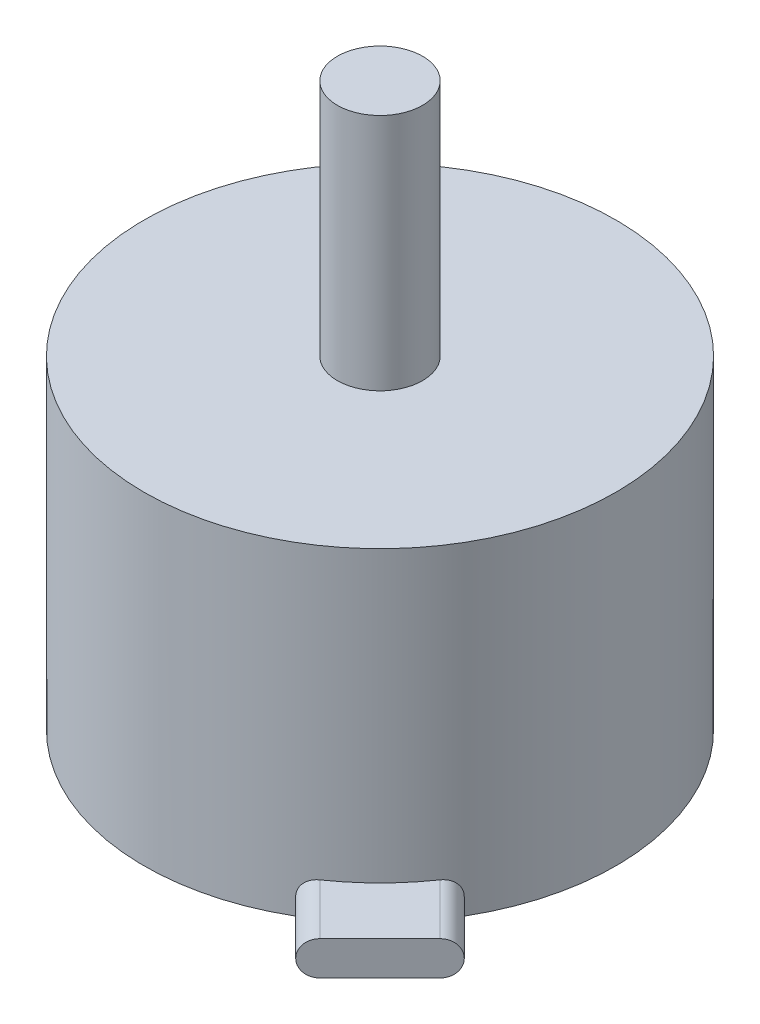
ISO-10303-21;
HEADER;
FILE_DESCRIPTION(('STEP AP214'),'2;1');
FILE_NAME('part.step','',(''),(''),'','','');
FILE_SCHEMA(('AUTOMOTIVE_DESIGN { 1 0 10303 214 1 1 1 1 }'));
ENDSEC;
DATA;
#1=APPLICATION_CONTEXT('core data for automotive mechanical design processes');
#2=APPLICATION_PROTOCOL_DEFINITION('international standard','automotive_design',2000,#1);
#3=PRODUCT_CONTEXT('',#1,'mechanical');
#4=PRODUCT('Part','Part','',(#3));
#5=PRODUCT_RELATED_PRODUCT_CATEGORY('part','',(#4));
#6=PRODUCT_DEFINITION_FORMATION('','',#4);
#7=PRODUCT_DEFINITION_CONTEXT('part definition',#1,'design');
#8=PRODUCT_DEFINITION('design','',#6,#7);
#9=PRODUCT_DEFINITION_SHAPE('','',#8);
#10=(LENGTH_UNIT() NAMED_UNIT(*) SI_UNIT(.MILLI.,.METRE.));
#11=(NAMED_UNIT(*) PLANE_ANGLE_UNIT() SI_UNIT($,.RADIAN.));
#12=(NAMED_UNIT(*) SI_UNIT($,.STERADIAN.) SOLID_ANGLE_UNIT());
#13=UNCERTAINTY_MEASURE_WITH_UNIT(LENGTH_MEASURE(1.E-05),#10,'distance_accuracy_value','');
#14=(GEOMETRIC_REPRESENTATION_CONTEXT(3) GLOBAL_UNCERTAINTY_ASSIGNED_CONTEXT((#13)) GLOBAL_UNIT_ASSIGNED_CONTEXT((#10,
#11,#12)) REPRESENTATION_CONTEXT('',''));
#15=CARTESIAN_POINT('',(0.,0.,0.));
#16=DIRECTION('',(0.,0.,1.));
#17=DIRECTION('',(1.,0.,0.));
#18=AXIS2_PLACEMENT_3D('',#15,#16,#17);
#19=CARTESIAN_POINT('',(0.,19.,0.));
#20=DIRECTION('',(0.,-1.,0.));
#21=DIRECTION('',(0.,0.,-1.));
#22=AXIS2_PLACEMENT_3D('',#19,#20,#21);
#23=CYLINDRICAL_SURFACE('',#22,13.85);
#24=CARTESIAN_POINT('',(0.,19.,0.));
#25=DIRECTION('',(0.,1.,0.));
#26=DIRECTION('',(0.,0.,1.));
#27=AXIS2_PLACEMENT_3D('',#24,#25,#26);
#28=CIRCLE('',#27,13.85);
#29=CARTESIAN_POINT('',(0.,19.,13.85));
#30=VERTEX_POINT('',#29);
#31=EDGE_CURVE('E13',#30,#30,#28,.T.);
#32=ORIENTED_EDGE('',*,*,#31,.F.);
#33=EDGE_LOOP('',(#32));
#34=FACE_BOUND('',#33,.T.);
#35=CARTESIAN_POINT('',(7.86479501158792,2.,11.4003289174349));
#36=CARTESIAN_POINT('',(7.81679979371891,2.00004181126576,11.4334566742897));
#37=CARTESIAN_POINT('',(7.76859718776109,1.99506724076578,11.4662463298621));
#38=CARTESIAN_POINT('',(7.67318775726975,1.975470471216,11.5303029294921));
#39=CARTESIAN_POINT('',(7.62598038634632,1.96085371605953,11.5615707220901));
#40=CARTESIAN_POINT('',(7.53390071781477,1.92235104763441,11.6217854828838));
#41=CARTESIAN_POINT('',(7.48902913454642,1.89846231744292,11.6507317425456));
#42=CARTESIAN_POINT('',(7.40299944011378,1.84207493210524,11.7055839973843));
#43=CARTESIAN_POINT('',(7.36184075616762,1.80957760804577,11.7314904616905));
#44=CARTESIAN_POINT('',(7.2845752626304,1.73685208282251,11.7796238844204));
#45=CARTESIAN_POINT('',(7.24846409057839,1.6966306297474,11.8018540232988));
#46=CARTESIAN_POINT('',(7.18248433676303,1.60950813238066,11.8421246496751));
#47=CARTESIAN_POINT('',(7.15261589462735,1.56260693872642,11.8601650434643));
#48=CARTESIAN_POINT('',(7.1007601370004,1.46444090796308,11.8912827422385));
#49=CARTESIAN_POINT('',(7.07862623091799,1.41328295988147,11.9044526735601));
#50=CARTESIAN_POINT('',(7.04227313514393,1.30728090771662,11.9259942609934));
#51=CARTESIAN_POINT('',(7.02805196408007,1.25243773028418,11.9343671183222));
#52=CARTESIAN_POINT('',(7.00839317681312,1.14235203009924,11.9459219893277));
#53=CARTESIAN_POINT('',(7.002709876839,1.08716853360768,11.9492492226176));
#54=CARTESIAN_POINT('',(6.99956768345788,0.97648993474323,11.9510901710874));
#55=CARTESIAN_POINT('',(7.00210797731422,0.92099486370433,11.9496043619396));
#56=CARTESIAN_POINT('',(7.0152002900489,0.812222714758384,11.9419227767333));
#57=CARTESIAN_POINT('',(7.0256206803709,0.758924209850059,11.9358043810016));
#58=CARTESIAN_POINT('',(7.05392017490369,0.655082113901077,11.9191013892866));
#59=CARTESIAN_POINT('',(7.07179951403629,0.604538609686679,11.9085166526345));
#60=CARTESIAN_POINT('',(7.11457712867047,0.507083546144395,11.8830095226615));
#61=CARTESIAN_POINT('',(7.13954147253354,0.460211742232406,11.868046256263));
#62=CARTESIAN_POINT('',(7.19555736087763,0.371848355972491,11.834167594756));
#63=CARTESIAN_POINT('',(7.22660939938955,0.330357210732137,11.8152518788887));
#64=CARTESIAN_POINT('',(7.29473166752902,0.252719458158474,11.7733185439426));
#65=CARTESIAN_POINT('',(7.331942898351,0.216749411035215,11.7502031489755));
#66=CARTESIAN_POINT('',(7.41060550853888,0.152434322815217,11.7007513405082));
#67=CARTESIAN_POINT('',(7.452058861012,0.124092852395435,11.674413427017));
#68=CARTESIAN_POINT('',(7.53907567922423,0.0751348032051979,11.6184156601448));
#69=CARTESIAN_POINT('',(7.58471735427174,0.0547352829606848,11.588687869675));
#70=CARTESIAN_POINT('',(7.67778604457916,0.0232966441420539,11.5272371613271));
#71=CARTESIAN_POINT('',(7.72521027010766,0.0122434871988992,11.4955173128154));
#72=CARTESIAN_POINT('',(7.78813327408547,0.00401188444310954,11.4528523879581));
#73=CARTESIAN_POINT('',(7.80348213669388,0.0025071794376331,11.4423998343775));
#74=CARTESIAN_POINT('',(7.83415729816906,0.000502552770113852,11.421419464053));
#75=CARTESIAN_POINT('',(7.84948359312084,1.00046290629164E-06,11.4108917974149));
#76=CARTESIAN_POINT('',(7.86479501158791,0.,11.4003289174349));
#77=B_SPLINE_CURVE_WITH_KNOTS('',3,(#35,#36,#37,#38,#39,#40,#41,#42,#43,#44,#45,#46,#47,#48,#49,
#50,#51,#52,#53,#54,#55,#56,#57,#58,#59,#60,#61,#62,#63,#64,#65,#66,#67,#68,#69,#70,#71,#72,#73,
#74,#75,#76),.UNSPECIFIED.,.F.,.F.,(4,2,2,2,2,2,2,2,2,2,2,2,2,2,2,2,2,2,2,2,4),(0.,
0.174711291418767,0.349324026693861,0.523989852717986,0.698628687134167,0.873115638950213,
1.04760649300179,1.21858362575953,1.38951792604849,1.55543236115734,1.72133039946569,
1.88451687023555,2.04770848099982,2.2124749053394,2.37725470640477,2.54652717864595,
2.71587874432985,2.8895791323072,3.06301815406453,3.11889117335948,3.1746732958679),.UNSPECIFIED.);
#78=CARTESIAN_POINT('',(7.86479501158661,2.,11.4003289174358));
#79=VERTEX_POINT('',#78);
#80=CARTESIAN_POINT('',(7.86479501158661,0.,11.4003289174358));
#81=VERTEX_POINT('',#80);
#82=EDGE_CURVE('E70',#79,#81,#77,.T.);
#83=ORIENTED_EDGE('',*,*,#82,.F.);
#84=CARTESIAN_POINT('',(0.,2.,0.));
#85=DIRECTION('',(0.,-1.,0.));
#86=DIRECTION('',(0.,0.,-1.));
#87=AXIS2_PLACEMENT_3D('',#84,#85,#86);
#88=CIRCLE('',#87,13.85);
#89=CARTESIAN_POINT('',(11.4003289174686,2.,7.86479501153908));
#90=VERTEX_POINT('',#89);
#91=EDGE_CURVE('E65',#79,#90,#88,.F.);
#92=ORIENTED_EDGE('',*,*,#91,.T.);
#93=CARTESIAN_POINT('',(11.4003289174348,0.,7.86479501158795));
#94=CARTESIAN_POINT('',(11.4334566742925,-4.18112732600964E-05,7.81679979371488));
#95=CARTESIAN_POINT('',(11.4662463298676,0.00493275922275054,7.7685971877531));
#96=CARTESIAN_POINT('',(11.5303029295028,0.0245295287676923,7.67318775725368));
#97=CARTESIAN_POINT('',(11.5615707221034,0.0391462839232908,7.62598038632613));
#98=CARTESIAN_POINT('',(11.6217854829025,0.0776489523457674,7.53390071778596));
#99=CARTESIAN_POINT('',(11.6507317425671,0.101537682535445,7.4890291345131));
#100=CARTESIAN_POINT('',(11.7055839974111,0.157925067871689,7.4029994400713));
#101=CARTESIAN_POINT('',(11.7314904617201,0.19042239193154,7.36184075612049));
#102=CARTESIAN_POINT('',(11.7796238844524,0.263147917161345,7.28457526257869));
#103=CARTESIAN_POINT('',(11.8018540233305,0.303369370242636,7.24846409052676));
#104=CARTESIAN_POINT('',(11.8421246497105,0.390491867614561,7.18248433670462));
#105=CARTESIAN_POINT('',(11.8601650435037,0.43739306126781,7.15261589456209));
#106=CARTESIAN_POINT('',(11.8912827422807,0.535559092031181,7.10076013692969));
#107=CARTESIAN_POINT('',(11.9044526736018,0.58671704011321,7.07862623084792));
#108=CARTESIAN_POINT('',(11.9259942610313,0.692719092277076,7.0422731350798));
#109=CARTESIAN_POINT('',(11.9343671183569,0.74756226970811,7.02805196402123));
#110=CARTESIAN_POINT('',(11.9459219893751,0.857647969890506,7.0083931767323));
#111=CARTESIAN_POINT('',(11.9492492226802,0.912831466381081,7.00270987673217));
#112=CARTESIAN_POINT('',(11.9510901711501,1.02351006524512,6.99956768335088));
#113=CARTESIAN_POINT('',(11.9496043619872,1.07900513628459,7.00210797723306));
#114=CARTESIAN_POINT('',(11.9419227767714,1.18777728523207,7.01520028998414));
#115=CARTESIAN_POINT('',(11.9358043810451,1.24107579014136,7.0256206802971));
#116=CARTESIAN_POINT('',(11.9191013893334,1.34491788609032,7.05392017482466));
#117=CARTESIAN_POINT('',(11.9085166526791,1.39546139030374,7.07179951396107));
#118=CARTESIAN_POINT('',(11.8830095227066,1.492916453847,7.11457712859527));
#119=CARTESIAN_POINT('',(11.8680462563106,1.53978825776099,7.13954147245444));
#120=CARTESIAN_POINT('',(11.8341675948057,1.62815164402231,7.195557360796));
#121=CARTESIAN_POINT('',(11.8152518789378,1.66964278926206,7.22660939930928));
#122=CARTESIAN_POINT('',(11.7733185439915,1.74728054182621,7.29473166745015));
#123=CARTESIAN_POINT('',(11.7502031490249,1.78325058894099,7.33194289827176));
#124=CARTESIAN_POINT('',(11.7007513405637,1.84756567715999,7.41060550845111));
#125=CARTESIAN_POINT('',(11.6744134270783,1.87590714758725,7.45205886091607));
#126=CARTESIAN_POINT('',(11.6184156602114,1.92486519677819,7.53907567912142));
#127=CARTESIAN_POINT('',(11.5886878697412,1.94526471701489,7.5847173541706));
#128=CARTESIAN_POINT('',(11.5272371613954,1.97670335583774,7.67778604447668));
#129=CARTESIAN_POINT('',(11.4955173128863,1.98775651279287,7.72521027000219));
#130=CARTESIAN_POINT('',(11.4528523880186,1.99598811555518,7.78813327399655));
#131=CARTESIAN_POINT('',(11.4423998344259,1.99749282056194,7.80348213662285));
#132=CARTESIAN_POINT('',(11.4214194640773,1.99949744723032,7.83415729813374));
#133=CARTESIAN_POINT('',(11.410891797427,1.99999899953711,7.84948359310333));
#134=CARTESIAN_POINT('',(11.4003289174349,2.,7.86479501158795));
#135=B_SPLINE_CURVE_WITH_KNOTS('',3,(#93,#94,#95,#96,#97,#98,#99,#100,#101,#102,#103,#104,#105,
#106,#107,#108,#109,#110,#111,#112,#113,#114,#115,#116,#117,#118,#119,#120,#121,#122,#123,#124,
#125,#126,#127,#128,#129,#130,#131,#132,#133,#134),.UNSPECIFIED.,.F.,.F.,(4,2,2,2,2,2,2,2,2,2,2,
2,2,2,2,2,2,2,2,2,4),(0.,0.174711291432094,0.349324026720439,0.523989852757187,
0.698628687186005,0.873115639014914,1.0476064930793,1.21858362583374,1.38951792611937,
1.55543236123204,1.72133039954422,1.88451687031421,2.0477084810786,2.21247490541741,
2.37725470648197,2.54652717870805,2.71587874437677,2.88957913235052,3.06301815410453,
3.11889117346406,3.17467329603689),.UNSPECIFIED.);
#136=CARTESIAN_POINT('',(11.4003289175949,0.,7.86479501163436));
#137=VERTEX_POINT('',#136);
#138=EDGE_CURVE('E111',#137,#90,#135,.T.);
#139=ORIENTED_EDGE('',*,*,#138,.F.);
#140=CARTESIAN_POINT('',(0.,0.,0.));
#141=DIRECTION('',(0.,1.,0.));
#142=DIRECTION('',(0.,0.,1.));
#143=AXIS2_PLACEMENT_3D('',#140,#141,#142);
#144=CIRCLE('',#143,13.85);
#145=EDGE_CURVE('E54',#137,#81,#144,.T.);
#146=ORIENTED_EDGE('',*,*,#145,.T.);
#147=EDGE_LOOP('',(#83,#92,#139,#146));
#148=FACE_BOUND('',#147,.T.);
#149=ADVANCED_FACE('F51',(#34,#148),#23,.T.);
#150=CARTESIAN_POINT('',(0.,19.,0.));
#151=DIRECTION('',(0.,1.,0.));
#152=DIRECTION('',(0.,0.,1.));
#153=AXIS2_PLACEMENT_3D('',#150,#151,#152);
#154=PLANE('',#153);
#155=CARTESIAN_POINT('',(0.,19.,0.));
#156=DIRECTION('',(0.,1.,0.));
#157=DIRECTION('',(0.,0.,1.));
#158=AXIS2_PLACEMENT_3D('',#155,#156,#157);
#159=CIRCLE('',#158,2.5);
#160=CARTESIAN_POINT('',(0.,19.,2.5));
#161=VERTEX_POINT('',#160);
#162=EDGE_CURVE('E148',#161,#161,#159,.T.);
#163=ORIENTED_EDGE('',*,*,#162,.F.);
#164=EDGE_LOOP('',(#163));
#165=FACE_BOUND('',#164,.T.);
#166=ORIENTED_EDGE('',*,*,#31,.T.);
#167=EDGE_LOOP('',(#166));
#168=FACE_BOUND('',#167,.T.);
#169=ADVANCED_FACE('F156',(#165,#168),#154,.T.);
#170=CARTESIAN_POINT('',(0.,0.,0.));
#171=DIRECTION('',(0.,1.,0.));
#172=DIRECTION('',(0.,0.,1.));
#173=AXIS2_PLACEMENT_3D('',#170,#171,#172);
#174=PLANE('',#173);
#175=CARTESIAN_POINT('',(0.,0.,8.));
#176=DIRECTION('',(0.,-1.,0.));
#177=DIRECTION('',(0.,0.,-1.));
#178=AXIS2_PLACEMENT_3D('',#175,#176,#177);
#179=CIRCLE('',#178,1.24999999999999);
#180=CARTESIAN_POINT('',(0.,0.,6.75000000000001));
#181=VERTEX_POINT('',#180);
#182=EDGE_CURVE('E119',#181,#181,#179,.T.);
#183=ORIENTED_EDGE('',*,*,#182,.F.);
#184=EDGE_LOOP('',(#183));
#185=FACE_BOUND('',#184,.T.);
#186=CARTESIAN_POINT('',(-9.5,0.,0.));
#187=DIRECTION('',(0.,-1.,0.));
#188=DIRECTION('',(0.,0.,-1.));
#189=AXIS2_PLACEMENT_3D('',#186,#187,#188);
#190=CIRCLE('',#189,1.24999999999999);
#191=CARTESIAN_POINT('',(-9.5,0.,-1.24999999999999));
#192=VERTEX_POINT('',#191);
#193=EDGE_CURVE('E130',#192,#192,#190,.T.);
#194=ORIENTED_EDGE('',*,*,#193,.F.);
#195=EDGE_LOOP('',(#194));
#196=FACE_BOUND('',#195,.T.);
#197=CARTESIAN_POINT('',(0.,0.,-8.));
#198=DIRECTION('',(0.,-1.,0.));
#199=DIRECTION('',(0.,0.,-1.));
#200=AXIS2_PLACEMENT_3D('',#197,#198,#199);
#201=CIRCLE('',#200,1.24999999999999);
#202=CARTESIAN_POINT('',(0.,0.,-9.24999999999999));
#203=VERTEX_POINT('',#202);
#204=EDGE_CURVE('E136',#203,#203,#201,.T.);
#205=ORIENTED_EDGE('',*,*,#204,.F.);
#206=EDGE_LOOP('',(#205));
#207=FACE_BOUND('',#206,.T.);
#208=CARTESIAN_POINT('',(9.5,0.,0.));
#209=DIRECTION('',(0.,-1.,0.));
#210=DIRECTION('',(0.,0.,-1.));
#211=AXIS2_PLACEMENT_3D('',#208,#209,#210);
#212=CIRCLE('',#211,1.24999999999999);
#213=CARTESIAN_POINT('',(9.5,0.,-1.24999999999999));
#214=VERTEX_POINT('',#213);
#215=EDGE_CURVE('E142',#214,#214,#212,.T.);
#216=ORIENTED_EDGE('',*,*,#215,.F.);
#217=EDGE_LOOP('',(#216));
#218=FACE_BOUND('',#217,.T.);
#219=ORIENTED_EDGE('',*,*,#145,.F.);
#220=DIRECTION('',(-0.707106781186546,0.,-0.707106781186549));
#221=VECTOR('',#220,1.);
#222=CARTESIAN_POINT('',(14.3896229971462,0.,10.8540890912135));
#223=LINE('',#222,#221);
#224=CARTESIAN_POINT('',(14.3896229971462,0.,10.8540890912135));
#225=VERTEX_POINT('',#224);
#226=EDGE_CURVE('E105',#225,#137,#223,.T.);
#227=ORIENTED_EDGE('',*,*,#226,.F.);
#228=DIRECTION('',(0.707106781186549,0.,-0.707106781186546));
#229=VECTOR('',#228,1.);
#230=CARTESIAN_POINT('',(10.8540890912135,0.,14.3896229971463));
#231=LINE('',#230,#229);
#232=CARTESIAN_POINT('',(10.8540890912135,0.,14.3896229971463));
#233=VERTEX_POINT('',#232);
#234=EDGE_CURVE('E377',#233,#225,#231,.T.);
#235=ORIENTED_EDGE('',*,*,#234,.F.);
#236=DIRECTION('',(-0.707106781186546,0.,-0.707106781186549));
#237=VECTOR('',#236,1.);
#238=CARTESIAN_POINT('',(10.8540890912135,0.,14.3896229971463));
#239=LINE('',#238,#237);
#240=EDGE_CURVE('E108',#233,#81,#239,.T.);
#241=ORIENTED_EDGE('',*,*,#240,.T.);
#242=EDGE_LOOP('',(#219,#227,#235,#241));
#243=FACE_BOUND('',#242,.T.);
#244=ADVANCED_FACE('F103',(#185,#196,#207,#218,#243),#174,.F.);
#245=CARTESIAN_POINT('',(0.,33.,0.));
#246=DIRECTION('',(0.,-1.,0.));
#247=DIRECTION('',(0.,0.,-1.));
#248=AXIS2_PLACEMENT_3D('',#245,#246,#247);
#249=CYLINDRICAL_SURFACE('',#248,2.5);
#250=CARTESIAN_POINT('',(0.,33.,0.));
#251=DIRECTION('',(0.,1.,0.));
#252=DIRECTION('',(0.,0.,1.));
#253=AXIS2_PLACEMENT_3D('',#250,#251,#252);
#254=CIRCLE('',#253,2.5);
#255=CARTESIAN_POINT('',(0.,33.,2.5));
#256=VERTEX_POINT('',#255);
#257=EDGE_CURVE('E109',#256,#256,#254,.T.);
#258=ORIENTED_EDGE('',*,*,#257,.F.);
#259=EDGE_LOOP('',(#258));
#260=FACE_BOUND('',#259,.T.);
#261=ORIENTED_EDGE('',*,*,#162,.T.);
#262=EDGE_LOOP('',(#261));
#263=FACE_BOUND('',#262,.T.);
#264=ADVANCED_FACE('F154',(#260,#263),#249,.T.);
#265=CARTESIAN_POINT('',(0.,33.,0.));
#266=DIRECTION('',(0.,1.,0.));
#267=DIRECTION('',(0.,0.,1.));
#268=AXIS2_PLACEMENT_3D('',#265,#266,#267);
#269=PLANE('',#268);
#270=ORIENTED_EDGE('',*,*,#257,.T.);
#271=EDGE_LOOP('',(#270));
#272=FACE_BOUND('',#271,.T.);
#273=ADVANCED_FACE('F256',(#272),#269,.T.);
#274=CARTESIAN_POINT('',(9.5,7.50000000000001,0.));
#275=DIRECTION('',(0.,-1.,0.));
#276=DIRECTION('',(0.,0.,-1.));
#277=AXIS2_PLACEMENT_3D('',#274,#275,#276);
#278=CONICAL_SURFACE('',#277,1.24999999999999,1.02974425867665);
#279=CARTESIAN_POINT('',(9.5,8.25107577378445,0.));
#280=VERTEX_POINT('',#279);
#281=VERTEX_LOOP('',#280);
#282=FACE_BOUND('',#281,.T.);
#283=CARTESIAN_POINT('',(9.5,7.50000000000001,0.));
#284=DIRECTION('',(0.,-1.,0.));
#285=DIRECTION('',(0.,0.,-1.));
#286=AXIS2_PLACEMENT_3D('',#283,#284,#285);
#287=CIRCLE('',#286,1.24999999999999);
#288=CARTESIAN_POINT('',(9.5,7.50000000000001,-1.24999999999999));
#289=VERTEX_POINT('',#288);
#290=EDGE_CURVE('E145',#289,#289,#287,.T.);
#291=ORIENTED_EDGE('',*,*,#290,.T.);
#292=EDGE_LOOP('',(#291));
#293=FACE_BOUND('',#292,.T.);
#294=ADVANCED_FACE('F252',(#282,#293),#278,.F.);
#295=CARTESIAN_POINT('',(9.5,0.,0.));
#296=DIRECTION('',(0.,-1.,0.));
#297=DIRECTION('',(0.,0.,-1.));
#298=AXIS2_PLACEMENT_3D('',#295,#296,#297);
#299=CYLINDRICAL_SURFACE('',#298,1.24999999999999);
#300=ORIENTED_EDGE('',*,*,#290,.F.);
#301=EDGE_LOOP('',(#300));
#302=FACE_BOUND('',#301,.T.);
#303=ORIENTED_EDGE('',*,*,#215,.T.);
#304=EDGE_LOOP('',(#303));
#305=FACE_BOUND('',#304,.T.);
#306=ADVANCED_FACE('F248',(#302,#305),#299,.F.);
#307=CARTESIAN_POINT('',(0.,7.50000000000001,-8.));
#308=DIRECTION('',(0.,-1.,0.));
#309=DIRECTION('',(0.,0.,-1.));
#310=AXIS2_PLACEMENT_3D('',#307,#308,#309);
#311=CONICAL_SURFACE('',#310,1.24999999999999,1.02974425867665);
#312=CARTESIAN_POINT('',(0.,8.25107577378445,-8.));
#313=VERTEX_POINT('',#312);
#314=VERTEX_LOOP('',#313);
#315=FACE_BOUND('',#314,.T.);
#316=CARTESIAN_POINT('',(0.,7.50000000000001,-8.));
#317=DIRECTION('',(0.,-1.,0.));
#318=DIRECTION('',(0.,0.,-1.));
#319=AXIS2_PLACEMENT_3D('',#316,#317,#318);
#320=CIRCLE('',#319,1.24999999999999);
#321=CARTESIAN_POINT('',(0.,7.50000000000001,-9.24999999999999));
#322=VERTEX_POINT('',#321);
#323=EDGE_CURVE('E139',#322,#322,#320,.T.);
#324=ORIENTED_EDGE('',*,*,#323,.T.);
#325=EDGE_LOOP('',(#324));
#326=FACE_BOUND('',#325,.T.);
#327=ADVANCED_FACE('F244',(#315,#326),#311,.F.);
#328=CARTESIAN_POINT('',(0.,0.,-8.));
#329=DIRECTION('',(0.,-1.,0.));
#330=DIRECTION('',(0.,0.,-1.));
#331=AXIS2_PLACEMENT_3D('',#328,#329,#330);
#332=CYLINDRICAL_SURFACE('',#331,1.24999999999999);
#333=ORIENTED_EDGE('',*,*,#323,.F.);
#334=EDGE_LOOP('',(#333));
#335=FACE_BOUND('',#334,.T.);
#336=ORIENTED_EDGE('',*,*,#204,.T.);
#337=EDGE_LOOP('',(#336));
#338=FACE_BOUND('',#337,.T.);
#339=ADVANCED_FACE('F240',(#335,#338),#332,.F.);
#340=CARTESIAN_POINT('',(-9.5,7.50000000000001,0.));
#341=DIRECTION('',(0.,-1.,0.));
#342=DIRECTION('',(0.,0.,-1.));
#343=AXIS2_PLACEMENT_3D('',#340,#341,#342);
#344=CONICAL_SURFACE('',#343,1.24999999999999,1.02974425867665);
#345=CARTESIAN_POINT('',(-9.5,8.25107577378445,0.));
#346=VERTEX_POINT('',#345);
#347=VERTEX_LOOP('',#346);
#348=FACE_BOUND('',#347,.T.);
#349=CARTESIAN_POINT('',(-9.5,7.50000000000001,0.));
#350=DIRECTION('',(0.,-1.,0.));
#351=DIRECTION('',(0.,0.,-1.));
#352=AXIS2_PLACEMENT_3D('',#349,#350,#351);
#353=CIRCLE('',#352,1.24999999999999);
#354=CARTESIAN_POINT('',(-9.5,7.50000000000001,-1.24999999999999));
#355=VERTEX_POINT('',#354);
#356=EDGE_CURVE('E133',#355,#355,#353,.T.);
#357=ORIENTED_EDGE('',*,*,#356,.T.);
#358=EDGE_LOOP('',(#357));
#359=FACE_BOUND('',#358,.T.);
#360=ADVANCED_FACE('F236',(#348,#359),#344,.F.);
#361=CARTESIAN_POINT('',(-9.5,0.,0.));
#362=DIRECTION('',(0.,-1.,0.));
#363=DIRECTION('',(0.,0.,-1.));
#364=AXIS2_PLACEMENT_3D('',#361,#362,#363);
#365=CYLINDRICAL_SURFACE('',#364,1.24999999999999);
#366=ORIENTED_EDGE('',*,*,#356,.F.);
#367=EDGE_LOOP('',(#366));
#368=FACE_BOUND('',#367,.T.);
#369=ORIENTED_EDGE('',*,*,#193,.T.);
#370=EDGE_LOOP('',(#369));
#371=FACE_BOUND('',#370,.T.);
#372=ADVANCED_FACE('F232',(#368,#371),#365,.F.);
#373=CARTESIAN_POINT('',(0.,7.50000000000001,8.));
#374=DIRECTION('',(0.,-1.,0.));
#375=DIRECTION('',(0.,0.,-1.));
#376=AXIS2_PLACEMENT_3D('',#373,#374,#375);
#377=CONICAL_SURFACE('',#376,1.24999999999999,1.02974425867665);
#378=CARTESIAN_POINT('',(0.,8.25107577378445,8.));
#379=VERTEX_POINT('',#378);
#380=VERTEX_LOOP('',#379);
#381=FACE_BOUND('',#380,.T.);
#382=CARTESIAN_POINT('',(0.,7.50000000000001,8.));
#383=DIRECTION('',(0.,-1.,0.));
#384=DIRECTION('',(0.,0.,-1.));
#385=AXIS2_PLACEMENT_3D('',#382,#383,#384);
#386=CIRCLE('',#385,1.24999999999999);
#387=CARTESIAN_POINT('',(0.,7.50000000000001,6.75000000000001));
#388=VERTEX_POINT('',#387);
#389=EDGE_CURVE('E127',#388,#388,#386,.T.);
#390=ORIENTED_EDGE('',*,*,#389,.T.);
#391=EDGE_LOOP('',(#390));
#392=FACE_BOUND('',#391,.T.);
#393=ADVANCED_FACE('F228',(#381,#392),#377,.F.);
#394=CARTESIAN_POINT('',(0.,0.,8.));
#395=DIRECTION('',(0.,-1.,0.));
#396=DIRECTION('',(0.,0.,-1.));
#397=AXIS2_PLACEMENT_3D('',#394,#395,#396);
#398=CYLINDRICAL_SURFACE('',#397,1.24999999999999);
#399=ORIENTED_EDGE('',*,*,#389,.F.);
#400=EDGE_LOOP('',(#399));
#401=FACE_BOUND('',#400,.T.);
#402=ORIENTED_EDGE('',*,*,#182,.T.);
#403=EDGE_LOOP('',(#402));
#404=FACE_BOUND('',#403,.T.);
#405=ADVANCED_FACE('F172',(#401,#404),#398,.F.);
#406=CARTESIAN_POINT('',(10.8540890912135,1.,14.3896229971463));
#407=DIRECTION('',(-0.707106781186546,0.,-0.707106781186549));
#408=DIRECTION('',(-0.707106781186549,0.,0.707106781186546));
#409=AXIS2_PLACEMENT_3D('',#406,#407,#408);
#410=CYLINDRICAL_SURFACE('',#409,1.);
#411=DIRECTION('',(-0.707106781186546,0.,-0.707106781186549));
#412=VECTOR('',#411,1.);
#413=CARTESIAN_POINT('',(10.8540890912135,2.,14.3896229971463));
#414=LINE('',#413,#412);
#415=CARTESIAN_POINT('',(10.8540890912135,2.,14.3896229971463));
#416=VERTEX_POINT('',#415);
#417=EDGE_CURVE('E121',#416,#79,#414,.T.);
#418=ORIENTED_EDGE('',*,*,#417,.T.);
#419=ORIENTED_EDGE('',*,*,#82,.T.);
#420=ORIENTED_EDGE('',*,*,#240,.F.);
#421=CARTESIAN_POINT('',(10.8540890912135,1.,14.3896229971463));
#422=DIRECTION('',(0.707106781186546,0.,0.707106781186549));
#423=DIRECTION('',(0.707106781186549,0.,-0.707106781186546));
#424=AXIS2_PLACEMENT_3D('',#421,#422,#423);
#425=CIRCLE('',#424,1.);
#426=EDGE_CURVE('E376',#416,#233,#425,.T.);
#427=ORIENTED_EDGE('',*,*,#426,.F.);
#428=EDGE_LOOP('',(#418,#419,#420,#427));
#429=FACE_BOUND('',#428,.T.);
#430=ADVANCED_FACE('F186',(#429),#410,.T.);
#431=CARTESIAN_POINT('',(14.3896229971462,1.,10.8540890912135));
#432=DIRECTION('',(-0.707106781186546,0.,-0.707106781186549));
#433=DIRECTION('',(-0.707106781186549,0.,0.707106781186546));
#434=AXIS2_PLACEMENT_3D('',#431,#432,#433);
#435=CYLINDRICAL_SURFACE('',#434,1.);
#436=ORIENTED_EDGE('',*,*,#226,.T.);
#437=ORIENTED_EDGE('',*,*,#138,.T.);
#438=DIRECTION('',(-0.707106781186546,0.,-0.707106781186549));
#439=VECTOR('',#438,1.);
#440=CARTESIAN_POINT('',(14.3896229971462,2.,10.8540890912135));
#441=LINE('',#440,#439);
#442=CARTESIAN_POINT('',(14.3896229971462,2.,10.8540890912135));
#443=VERTEX_POINT('',#442);
#444=EDGE_CURVE('E117',#443,#90,#441,.T.);
#445=ORIENTED_EDGE('',*,*,#444,.F.);
#446=CARTESIAN_POINT('',(14.3896229971462,1.,10.8540890912135));
#447=DIRECTION('',(0.707106781186546,0.,0.707106781186549));
#448=DIRECTION('',(0.707106781186549,0.,-0.707106781186546));
#449=AXIS2_PLACEMENT_3D('',#446,#447,#448);
#450=CIRCLE('',#449,1.);
#451=EDGE_CURVE('E116',#225,#443,#450,.T.);
#452=ORIENTED_EDGE('',*,*,#451,.F.);
#453=EDGE_LOOP('',(#436,#437,#445,#452));
#454=FACE_BOUND('',#453,.T.);
#455=ADVANCED_FACE('F115',(#454),#435,.T.);
#456=CARTESIAN_POINT('',(10.8540890912135,2.,14.3896229971463));
#457=DIRECTION('',(0.,1.,0.));
#458=DIRECTION('',(0.,0.,1.));
#459=AXIS2_PLACEMENT_3D('',#456,#457,#458);
#460=PLANE('',#459);
#461=ORIENTED_EDGE('',*,*,#91,.F.);
#462=ORIENTED_EDGE('',*,*,#417,.F.);
#463=DIRECTION('',(0.707106781186549,0.,-0.707106781186546));
#464=VECTOR('',#463,1.);
#465=CARTESIAN_POINT('',(10.8540890912135,2.,14.3896229971463));
#466=LINE('',#465,#464);
#467=EDGE_CURVE('E383',#416,#443,#466,.T.);
#468=ORIENTED_EDGE('',*,*,#467,.T.);
#469=ORIENTED_EDGE('',*,*,#444,.T.);
#470=EDGE_LOOP('',(#461,#462,#468,#469));
#471=FACE_BOUND('',#470,.T.);
#472=ADVANCED_FACE('F198',(#471),#460,.T.);
#473=CARTESIAN_POINT('',(10.8540890912135,1.,14.3896229971463));
#474=DIRECTION('',(0.707106781186546,0.,0.707106781186549));
#475=DIRECTION('',(0.707106781186549,0.,-0.707106781186546));
#476=AXIS2_PLACEMENT_3D('',#473,#474,#475);
#477=PLANE('',#476);
#478=ORIENTED_EDGE('',*,*,#426,.T.);
#479=ORIENTED_EDGE('',*,*,#234,.T.);
#480=ORIENTED_EDGE('',*,*,#451,.T.);
#481=ORIENTED_EDGE('',*,*,#467,.F.);
#482=EDGE_LOOP('',(#478,#479,#480,#481));
#483=FACE_BOUND('',#482,.T.);
#484=ADVANCED_FACE('F207',(#483),#477,.T.);
#485=CLOSED_SHELL('',(#149,#169,#244,#264,#273,#294,#306,#327,#339,#360,#372,#393,#405,#430,
#455,#472,#484));
#486=MANIFOLD_SOLID_BREP('B2',#485);
#487=ADVANCED_BREP_SHAPE_REPRESENTATION('',(#18,#486),#14);
#488=SHAPE_DEFINITION_REPRESENTATION(#9,#487);
ENDSEC;
END-ISO-10303-21;
